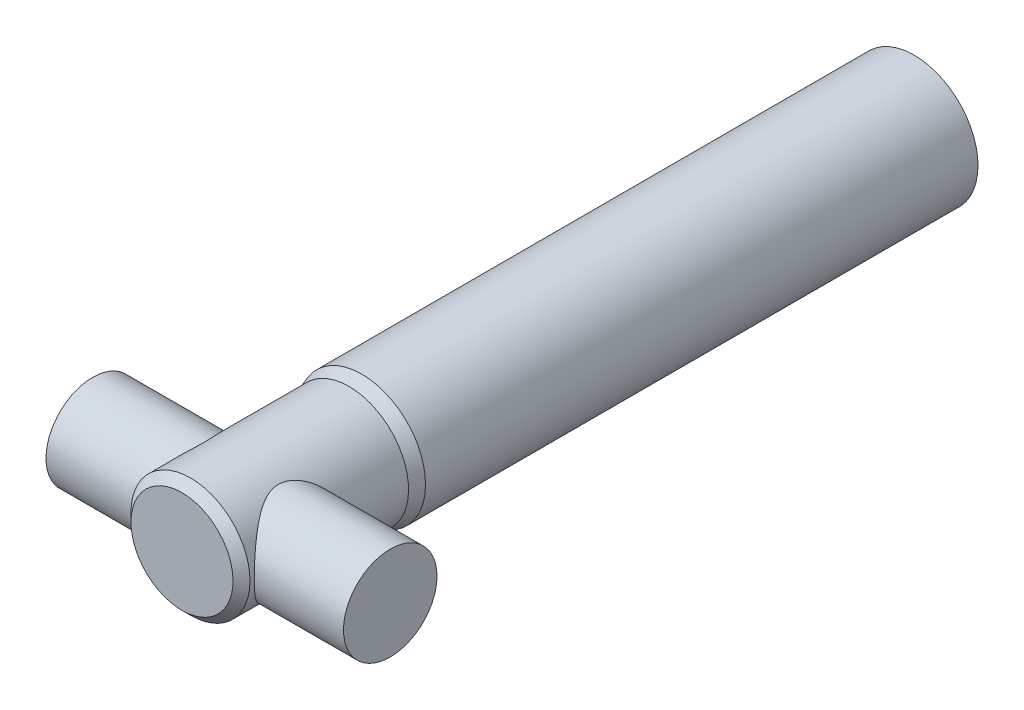
ISO-10303-21;
HEADER;
FILE_DESCRIPTION(('STEP AP214'),'2;1');
FILE_NAME('part.step','',(''),(''),'','','');
FILE_SCHEMA(('AUTOMOTIVE_DESIGN { 1 0 10303 214 1 1 1 1 }'));
ENDSEC;
DATA;
#1=APPLICATION_CONTEXT('core data for automotive mechanical design processes');
#2=APPLICATION_PROTOCOL_DEFINITION('international standard','automotive_design',2000,#1);
#3=PRODUCT_CONTEXT('',#1,'mechanical');
#4=PRODUCT('Part','Part','',(#3));
#5=PRODUCT_RELATED_PRODUCT_CATEGORY('part','',(#4));
#6=PRODUCT_DEFINITION_FORMATION('','',#4);
#7=PRODUCT_DEFINITION_CONTEXT('part definition',#1,'design');
#8=PRODUCT_DEFINITION('design','',#6,#7);
#9=PRODUCT_DEFINITION_SHAPE('','',#8);
#10=(LENGTH_UNIT() NAMED_UNIT(*) SI_UNIT(.MILLI.,.METRE.));
#11=(NAMED_UNIT(*) PLANE_ANGLE_UNIT() SI_UNIT($,.RADIAN.));
#12=(NAMED_UNIT(*) SI_UNIT($,.STERADIAN.) SOLID_ANGLE_UNIT());
#13=UNCERTAINTY_MEASURE_WITH_UNIT(LENGTH_MEASURE(1.E-05),#10,'distance_accuracy_value','');
#14=(GEOMETRIC_REPRESENTATION_CONTEXT(3) GLOBAL_UNCERTAINTY_ASSIGNED_CONTEXT((#13)) GLOBAL_UNIT_ASSIGNED_CONTEXT((#10,
#11,#12)) REPRESENTATION_CONTEXT('',''));
#15=CARTESIAN_POINT('',(0.,0.,0.));
#16=DIRECTION('',(0.,0.,1.));
#17=DIRECTION('',(1.,0.,0.));
#18=AXIS2_PLACEMENT_3D('',#15,#16,#17);
#19=CARTESIAN_POINT('',(0.,0.,130.));
#20=DIRECTION('',(0.,0.,-1.));
#21=DIRECTION('',(0.,1.,0.));
#22=AXIS2_PLACEMENT_3D('',#19,#20,#21);
#23=CYLINDRICAL_SURFACE('',#22,14.);
#24=CARTESIAN_POINT('',(0.,0.,170.3));
#25=DIRECTION('',(0.,0.,1.));
#26=DIRECTION('',(0.,-1.,0.));
#27=AXIS2_PLACEMENT_3D('',#24,#25,#26);
#28=CIRCLE('',#27,14.);
#29=CARTESIAN_POINT('',(0.,-14.,170.3));
#30=VERTEX_POINT('',#29);
#31=EDGE_CURVE('E58',#30,#30,#28,.F.);
#32=ORIENTED_EDGE('',*,*,#31,.T.);
#33=EDGE_LOOP('',(#32));
#34=FACE_BOUND('',#33,.T.);
#35=CARTESIAN_POINT('',(-14.,0.,169.3));
#36=CARTESIAN_POINT('',(-13.9999983020981,-0.265466786324723,169.299998254314));
#37=CARTESIAN_POINT('',(-13.9924325765758,-0.530963591409591,169.290373671565));
#38=CARTESIAN_POINT('',(-13.9623411819814,-1.05982996838332,169.25203676779));
#39=CARTESIAN_POINT('',(-13.9398080799739,-1.3231984175032,169.223314962902));
#40=CARTESIAN_POINT('',(-13.8802548331161,-1.84604435302479,169.147213291809));
#41=CARTESIAN_POINT('',(-13.8432086295765,-2.10551396389435,169.099799863289));
#42=CARTESIAN_POINT('',(-13.7554710989268,-2.61813687434712,168.987105980894));
#43=CARTESIAN_POINT('',(-13.7047811841976,-2.87129082475774,168.92182737639));
#44=CARTESIAN_POINT('',(-13.5911819530012,-3.36813213401964,168.774845434434));
#45=CARTESIAN_POINT('',(-13.5283514225214,-3.61186898304491,168.693247884536));
#46=CARTESIAN_POINT('',(-13.3914744973453,-4.09027178718101,168.51444552244));
#47=CARTESIAN_POINT('',(-13.317428053715,-4.32493770271056,168.417240642149));
#48=CARTESIAN_POINT('',(-13.1594291408938,-4.78418042798745,168.20834216801));
#49=CARTESIAN_POINT('',(-13.0754787805349,-5.00875937153341,168.096651658073));
#50=CARTESIAN_POINT('',(-12.8989847840232,-5.4472074677395,167.859813862915));
#51=CARTESIAN_POINT('',(-12.8064394219511,-5.66107445605585,167.734663874162));
#52=CARTESIAN_POINT('',(-12.5814694733874,-6.14824880000131,167.427309506395));
#53=CARTESIAN_POINT('',(-12.446164643204,-6.41711588357778,167.240150193891));
#54=CARTESIAN_POINT('',(-12.1657640325496,-6.93402514973809,166.845473419482));
#55=CARTESIAN_POINT('',(-12.0206652268966,-7.18206084429822,166.637949658302));
#56=CARTESIAN_POINT('',(-11.7235410038569,-7.65750353396232,166.203581359714));
#57=CARTESIAN_POINT('',(-11.5714983189204,-7.88485436702914,165.976687283778));
#58=CARTESIAN_POINT('',(-11.2642259522141,-8.31791382299805,165.505191057963));
#59=CARTESIAN_POINT('',(-11.1089966147273,-8.52362476929958,165.260590813903));
#60=CARTESIAN_POINT('',(-10.7967180361465,-8.91597608664955,164.750611365893));
#61=CARTESIAN_POINT('',(-10.6396750047223,-9.102297045149,164.484982491918));
#62=CARTESIAN_POINT('',(-10.3303157301918,-9.45193397170477,163.936206593476));
#63=CARTESIAN_POINT('',(-10.1780009229014,-9.61524300401537,163.653054324347));
#64=CARTESIAN_POINT('',(-9.8838097725818,-9.91738999970861,163.070000977611));
#65=CARTESIAN_POINT('',(-9.74190479027814,-10.0562966911596,162.770150177464));
#66=CARTESIAN_POINT('',(-9.47458547223412,-10.3085382479343,162.152920059512));
#67=CARTESIAN_POINT('',(-9.34915735162854,-10.4218945467957,161.835555713686));
#68=CARTESIAN_POINT('',(-9.16941263078586,-10.5796856375467,161.318327014121));
#69=CARTESIAN_POINT('',(-9.10710444778919,-10.6332626173461,161.123993392715));
#70=CARTESIAN_POINT('',(-8.9927048591134,-10.7301852097597,160.729871561394));
#71=CARTESIAN_POINT('',(-8.94060971889862,-10.7735345634262,160.530085375838));
#72=CARTESIAN_POINT('',(-8.84850683925216,-10.8493082663112,160.126103495336));
#73=CARTESIAN_POINT('',(-8.80847568073927,-10.8817537967564,159.921917179031));
#74=CARTESIAN_POINT('',(-8.74199011722624,-10.9352384406279,159.509840175406));
#75=CARTESIAN_POINT('',(-8.71553558935414,-10.9562776572845,159.30194952163));
#76=CARTESIAN_POINT('',(-8.67727733209552,-10.9866040786449,158.882330613135));
#77=CARTESIAN_POINT('',(-8.66558773795929,-10.9957997414291,158.670585145106));
#78=CARTESIAN_POINT('',(-8.65782499553423,-11.0019131246744,158.246635063247));
#79=CARTESIAN_POINT('',(-8.66175125829711,-10.9988313081775,158.034430467037));
#80=CARTESIAN_POINT('',(-8.68502871206392,-10.9804595050075,157.611224003095));
#81=CARTESIAN_POINT('',(-8.70439356112469,-10.965158708547,157.400223367014));
#82=CARTESIAN_POINT('',(-8.75761535337472,-10.9226973922513,156.981273687799));
#83=CARTESIAN_POINT('',(-8.79147434189971,-10.8955351985879,156.773325079636));
#84=CARTESIAN_POINT('',(-8.87942677304507,-10.8240260244805,156.324953998306));
#85=CARTESIAN_POINT('',(-8.93605750019766,-10.777473093471,156.085382583866));
#86=CARTESIAN_POINT('',(-9.06445775770566,-10.6697050529474,155.613745087713));
#87=CARTESIAN_POINT('',(-9.13623078566688,-10.6084865555013,155.381680754313));
#88=CARTESIAN_POINT('',(-9.29207211266342,-10.4722547095067,154.925279593194));
#89=CARTESIAN_POINT('',(-9.37616885264355,-10.3972093450419,154.700962164976));
#90=CARTESIAN_POINT('',(-9.55373083226909,-10.2342932159671,154.260903110036));
#91=CARTESIAN_POINT('',(-9.64719676514373,-10.146421502112,154.045162119539));
#92=CARTESIAN_POINT('',(-9.88442410250681,-9.91646434817246,153.527581084324));
#93=CARTESIAN_POINT('',(-10.0319732711895,-9.76771682640062,153.230422642264));
#94=CARTESIAN_POINT('',(-10.335333449104,-9.44615360861149,152.653832728578));
#95=CARTESIAN_POINT('',(-10.491147862878,-9.27332794612491,152.374408667672));
#96=CARTESIAN_POINT('',(-10.8061776836049,-8.90423857571701,151.833009865333));
#97=CARTESIAN_POINT('',(-10.9653965476636,-8.70795001376253,151.571054093613));
#98=CARTESIAN_POINT('',(-11.2828133220086,-8.29255461411112,151.065320216574));
#99=CARTESIAN_POINT('',(-11.4410113819469,-8.07345120572291,150.821539388799));
#100=CARTESIAN_POINT('',(-11.7557051229129,-7.60814225193955,150.348370930277));
#101=CARTESIAN_POINT('',(-11.9121066156436,-7.3614895623032,150.119359203392));
#102=CARTESIAN_POINT('',(-12.216221512472,-6.84498015214171,149.682539170338));
#103=CARTESIAN_POINT('',(-12.3639336869602,-6.57512016083225,149.474733862008));
#104=CARTESIAN_POINT('',(-12.6466079069709,-6.01347823961888,149.082894038075));
#105=CARTESIAN_POINT('',(-12.7815992921545,-5.72174968718987,148.898804444551));
#106=CARTESIAN_POINT('',(-13.0354912384641,-5.11696963977077,148.556426988802));
#107=CARTESIAN_POINT('',(-13.1543993873626,-4.80392830529129,148.398126952285));
#108=CARTESIAN_POINT('',(-13.3404746842738,-4.2532010059447,148.152455813518));
#109=CARTESIAN_POINT('',(-13.4125855517037,-4.02035981528025,148.057902475573));
#110=CARTESIAN_POINT('',(-13.5457290534993,-3.54596516246148,147.884151683903));
#111=CARTESIAN_POINT('',(-13.6067644246957,-3.30441387036591,147.804950436241));
#112=CARTESIAN_POINT('',(-13.7165895533296,-2.81394599397508,147.66294903859));
#113=CARTESIAN_POINT('',(-13.7653856829821,-2.56503331807762,147.600140353316));
#114=CARTESIAN_POINT('',(-13.8497815045618,-2.06125474078723,147.49178072745));
#115=CARTESIAN_POINT('',(-13.8853808128215,-1.80638866654178,147.446230288601));
#116=CARTESIAN_POINT('',(-13.9427314100867,-1.29138010586426,147.372956367761));
#117=CARTESIAN_POINT('',(-13.9644203287058,-1.03121917752045,147.345313171473));
#118=CARTESIAN_POINT('',(-13.9931977319387,-0.508778346888179,147.308652844574));
#119=CARTESIAN_POINT('',(-14.000286252122,-0.246498449763531,147.299635668586));
#120=CARTESIAN_POINT('',(-13.9996960166729,0.278009512880389,147.300386898407));
#121=CARTESIAN_POINT('',(-13.9920176485861,0.540237579579278,147.310154811217));
#122=CARTESIAN_POINT('',(-13.9620747335434,1.06248482048919,147.348302833958));
#123=CARTESIAN_POINT('',(-13.9398107111202,1.32250407379348,147.376682274579));
#124=CARTESIAN_POINT('',(-13.88319549443,1.82084291565739,147.449028360116));
#125=CARTESIAN_POINT('',(-13.8497632805995,2.05944104549108,147.491811434457));
#126=CARTESIAN_POINT('',(-13.7713100137218,2.53145321052372,147.592527062112));
#127=CARTESIAN_POINT('',(-13.726289591075,2.76486752697285,147.65045879134));
#128=CARTESIAN_POINT('',(-13.6254694876208,3.22523057781876,147.780726298518));
#129=CARTESIAN_POINT('',(-13.5696701882477,3.45217954068022,147.85306156677));
#130=CARTESIAN_POINT('',(-13.4482000967281,3.8986493431783,148.011333432764));
#131=CARTESIAN_POINT('',(-13.3825254946469,4.11816727567003,148.097275280663));
#132=CARTESIAN_POINT('',(-13.2369850347911,4.56526271474977,148.288908599948));
#133=CARTESIAN_POINT('',(-13.1564193030118,4.79218073826316,148.395605715582));
#134=CARTESIAN_POINT('',(-12.9863155719505,5.23565119477154,148.622704195371));
#135=CARTESIAN_POINT('',(-12.8967738887684,5.45219931743868,148.743111189096));
#136=CARTESIAN_POINT('',(-12.7100671048098,5.87430474763566,148.996604993562));
#137=CARTESIAN_POINT('',(-12.6129015536237,6.07986140459384,149.129692553557));
#138=CARTESIAN_POINT('',(-12.4122710766037,6.4796264365047,149.407659103169));
#139=CARTESIAN_POINT('',(-12.3088053052718,6.67383328141343,149.552539676307));
#140=CARTESIAN_POINT('',(-12.076293776484,7.0872969243098,149.882568981527));
#141=CARTESIAN_POINT('',(-11.9461859315793,7.30408219921029,150.070070007069));
#142=CARTESIAN_POINT('',(-11.6811800792678,7.7208163159309,150.459695874909));
#143=CARTESIAN_POINT('',(-11.5462827293612,7.92076745612231,150.661818713855));
#144=CARTESIAN_POINT('',(-11.2738248401161,8.30398803069368,151.080277343306));
#145=CARTESIAN_POINT('',(-11.1362607346037,8.48723294604124,151.296633246696));
#146=CARTESIAN_POINT('',(-10.8611961979661,8.83650477148732,151.742831679251));
#147=CARTESIAN_POINT('',(-10.7236957629572,9.00253292513358,151.972673232481));
#148=CARTESIAN_POINT('',(-10.4552847865941,9.31278348598826,152.439248811219));
#149=CARTESIAN_POINT('',(-10.3242967365558,9.4574762913146,152.675625139204));
#150=CARTESIAN_POINT('',(-10.0680637258111,9.72980164989494,153.161087016842));
#151=CARTESIAN_POINT('',(-9.94281964337171,9.85743159987109,153.410174497842));
#152=CARTESIAN_POINT('',(-9.70192746397449,10.0946086761143,153.920732288263));
#153=CARTESIAN_POINT('',(-9.58626396102627,10.2041851253826,154.182181612094));
#154=CARTESIAN_POINT('',(-9.36869929800787,10.4042929324955,154.717777335068));
#155=CARTESIAN_POINT('',(-9.26679138125834,10.4948336528769,154.991917411049));
#156=CARTESIAN_POINT('',(-9.1109587050962,10.6300277062168,155.464089432471));
#157=CARTESIAN_POINT('',(-9.05202806006739,10.6801537283675,155.658911793967));
#158=CARTESIAN_POINT('',(-8.94480238454955,10.7701165252613,156.053767256721));
#159=CARTESIAN_POINT('',(-8.89650390771088,10.8099566348432,156.253798645926));
#160=CARTESIAN_POINT('',(-8.81234133701151,10.8786763341108,156.657949719911));
#161=CARTESIAN_POINT('',(-8.77645455075857,10.9075759356661,156.862061214192));
#162=CARTESIAN_POINT('',(-8.71849444556228,10.9539601410702,157.27354426252));
#163=CARTESIAN_POINT('',(-8.69642086733625,10.971444959182,157.480915755299));
#164=CARTESIAN_POINT('',(-8.66702550020775,10.9946819266439,157.898727189171));
#165=CARTESIAN_POINT('',(-8.65980012037426,11.0003574011127,158.109178303414));
#166=CARTESIAN_POINT('',(-8.66075230715227,10.9996076823947,158.530017671241));
#167=CARTESIAN_POINT('',(-8.66892951823601,10.993182768513,158.740405926163));
#168=CARTESIAN_POINT('',(-8.70029347926512,10.9683766580998,159.159558538974));
#169=CARTESIAN_POINT('',(-8.72349608758353,10.9499828290228,159.368320945012));
#170=CARTESIAN_POINT('',(-8.78383014716833,10.9016424680038,159.782457737271));
#171=CARTESIAN_POINT('',(-8.82096365109482,10.8716942335492,159.987831619548));
#172=CARTESIAN_POINT('',(-8.9169985405825,10.7931354075333,160.438021001511));
#173=CARTESIAN_POINT('',(-8.97887307715571,10.7418872201405,160.681741123682));
#174=CARTESIAN_POINT('',(-9.11772937266534,10.6242771469901,161.161065402124));
#175=CARTESIAN_POINT('',(-9.19471518343286,10.5579112068964,161.396667361685));
#176=CARTESIAN_POINT('',(-9.36077761859899,10.4109630328551,161.859631420039));
#177=CARTESIAN_POINT('',(-9.44988217506742,10.3303478237317,162.086972898818));
#178=CARTESIAN_POINT('',(-9.63712943892932,10.1558911589253,162.532628858582));
#179=CARTESIAN_POINT('',(-9.73527268603141,10.0620489132658,162.750942799395));
#180=CARTESIAN_POINT('',(-9.98191224941213,9.81850355697994,163.271056992514));
#181=CARTESIAN_POINT('',(-10.1338355596977,9.6621888328227,163.568151270657));
#182=CARTESIAN_POINT('',(-10.4448846909376,9.32507724152265,164.144171936748));
#183=CARTESIAN_POINT('',(-10.6040133191854,9.14427077645119,164.423091138385));
#184=CARTESIAN_POINT('',(-10.9246235229077,8.7587400261217,164.96292482659));
#185=CARTESIAN_POINT('',(-11.0861071925577,8.55399315349223,165.223821934451));
#186=CARTESIAN_POINT('',(-11.4069965303405,8.12114657355916,165.726777881977));
#187=CARTESIAN_POINT('',(-11.5664025043524,7.89305034855054,165.968839521291));
#188=CARTESIAN_POINT('',(-11.8816080743876,7.41024398473724,166.436514182965));
#189=CARTESIAN_POINT('',(-12.0373212528652,7.15519442241601,166.661836068565));
#190=CARTESIAN_POINT('',(-12.3388844236082,6.62161931743809,167.090405859818));
#191=CARTESIAN_POINT('',(-12.4847328991417,6.34309017943759,167.293650373896));
#192=CARTESIAN_POINT('',(-12.7624347594877,5.76395428640985,167.67533095092));
#193=CARTESIAN_POINT('',(-12.894318389329,5.463397732547,167.853820898413));
#194=CARTESIAN_POINT('',(-13.1406169560295,4.84107419599956,168.18371645688));
#195=CARTESIAN_POINT('',(-13.2550415826491,4.5193191215366,168.335137099409));
#196=CARTESIAN_POINT('',(-13.4304272675694,3.95991068164669,168.565479253589));
#197=CARTESIAN_POINT('',(-13.4969488645249,3.72721800774293,168.652303214352));
#198=CARTESIAN_POINT('',(-13.6188110189529,3.25386829502407,168.810688758397));
#199=CARTESIAN_POINT('',(-13.6741544184181,3.01321329873839,168.882254221322));
#200=CARTESIAN_POINT('',(-13.7725240672289,2.52572525931351,169.009062316318));
#201=CARTESIAN_POINT('',(-13.815575859238,2.2789062042076,169.064338805607));
#202=CARTESIAN_POINT('',(-13.8886333871956,1.78025504698694,169.157946225526));
#203=CARTESIAN_POINT('',(-13.9186446251428,1.52842510603021,169.196284302831));
#204=CARTESIAN_POINT('',(-13.9611157369538,1.06402075391184,169.250478599471));
#205=CARTESIAN_POINT('',(-13.975675267127,0.851947333494551,169.269027228579));
#206=CARTESIAN_POINT('',(-13.9951192193843,0.426589251147054,169.293790081729));
#207=CARTESIAN_POINT('',(-14.0000013642754,0.213304315972458,169.300001402671));
#208=CARTESIAN_POINT('',(-14.,0.,169.3));
#209=B_SPLINE_CURVE_WITH_KNOTS('',3,(#35,#36,#37,#38,#39,#40,#41,#42,#43,#44,#45,#46,#47,#48,
#49,#50,#51,#52,#53,#54,#55,#56,#57,#58,#59,#60,#61,#62,#63,#64,#65,#66,#67,#68,#69,#70,#71,#72,
#73,#74,#75,#76,#77,#78,#79,#80,#81,#82,#83,#84,#85,#86,#87,#88,#89,#90,#91,#92,#93,#94,#95,#96,
#97,#98,#99,#100,#101,#102,#103,#104,#105,#106,#107,#108,#109,#110,#111,#112,#113,#114,#115,
#116,#117,#118,#119,#120,#121,#122,#123,#124,#125,#126,#127,#128,#129,#130,#131,#132,#133,#134,
#135,#136,#137,#138,#139,#140,#141,#142,#143,#144,#145,#146,#147,#148,#149,#150,#151,#152,#153,
#154,#155,#156,#157,#158,#159,#160,#161,#162,#163,#164,#165,#166,#167,#168,#169,#170,#171,#172,
#173,#174,#175,#176,#177,#178,#179,#180,#181,#182,#183,#184,#185,#186,#187,#188,#189,#190,#191,
#192,#193,#194,#195,#196,#197,#198,#199,#200,#201,#202,#203,#204,#205,#206,#207,#208),
.UNSPECIFIED.,.T.,.F.,(4,2,2,2,2,2,2,2,2,2,2,2,2,2,2,2,2,2,2,2,2,2,2,2,2,2,2,2,2,2,2,2,2,2,2,2,
2,2,2,2,2,2,2,2,2,2,2,2,2,2,2,2,2,2,2,2,2,2,2,2,2,2,2,2,2,2,2,2,2,2,2,2,2,2,2,2,2,2,2,2,2,2,2,2,
2,2,4),(0.,0.796173088899271,1.592741860504,2.39074749818668,3.18867055901866,3.98157962090334,
4.7744921422795,5.56723613321038,6.36013965671869,7.4219555710497,8.48410097539703,
9.54904916354969,10.613882894965,11.6941413376321,12.774724674662,13.8522140259226,
14.9287961081879,15.5613033580998,16.1935788901114,16.8246189980114,17.4556533947379,
18.0915365146554,18.7273956526213,19.3638179412454,20.0003300680121,20.7507930169512,
21.5014294998198,22.2538264270961,23.0062790655836,24.0955066319602,25.1851864004092,
26.2760308599142,27.366711590191,28.4787763276204,29.5909980545952,30.7005882887521,
31.8096531991728,32.5932537038495,33.3766603110225,34.1596581962888,34.942678843646,
35.7291862405157,36.5156917212876,37.3021765611064,38.0886331187224,38.8219175877846,
39.5551621744832,40.2883808184692,41.0218830706589,41.8112494429655,42.6009411229773,
43.3906794922703,44.1805240800878,45.123944086523,46.0672350778496,47.0118889314333,
47.9564745061147,48.8753587680842,49.7943830645146,50.7118996177263,51.6289638382211,
52.2573228884639,52.8854779592234,53.5124784214944,54.1394671142159,54.7705141321174,
55.4015465841587,56.0332461396318,56.6650388100133,57.4337185979515,58.2026047765436,
58.9732941543953,59.7440295806995,60.8479384027133,61.9522810875916,63.0576742387487,
64.1629027723915,65.2842389239412,66.4057470946938,67.5247743619672,68.6431782912984,
69.4137985995219,70.1842227346338,70.9530340336321,71.7215206442972,72.361100497038,
73.0008308319493),.UNSPECIFIED.);
#210=CARTESIAN_POINT('',(-14.,0.,169.3));
#211=VERTEX_POINT('',#210);
#212=EDGE_CURVE('E78',#211,#211,#209,.T.);
#213=ORIENTED_EDGE('',*,*,#212,.T.);
#214=EDGE_LOOP('',(#213));
#215=FACE_BOUND('',#214,.T.);
#216=CARTESIAN_POINT('',(0.,0.,133.));
#217=DIRECTION('',(0.,0.,-1.));
#218=DIRECTION('',(0.,1.,0.));
#219=AXIS2_PLACEMENT_3D('',#216,#217,#218);
#220=CIRCLE('',#219,14.);
#221=CARTESIAN_POINT('',(0.,14.,133.));
#222=VERTEX_POINT('',#221);
#223=EDGE_CURVE('E77',#222,#222,#220,.T.);
#224=ORIENTED_EDGE('',*,*,#223,.F.);
#225=EDGE_LOOP('',(#224));
#226=FACE_BOUND('',#225,.T.);
#227=CARTESIAN_POINT('',(14.,0.,169.3));
#228=CARTESIAN_POINT('',(13.9999983020981,0.265466786324724,169.299998254314));
#229=CARTESIAN_POINT('',(13.9924325765758,0.530963591409594,169.290373671565));
#230=CARTESIAN_POINT('',(13.9623411819814,1.05982996838333,169.25203676779));
#231=CARTESIAN_POINT('',(13.9398080799739,1.3231984175032,169.223314962902));
#232=CARTESIAN_POINT('',(13.8802548331161,1.8460443530248,169.147213291809));
#233=CARTESIAN_POINT('',(13.8432086295765,2.10551396389437,169.099799863289));
#234=CARTESIAN_POINT('',(13.7554710989268,2.61813687434713,168.987105980894));
#235=CARTESIAN_POINT('',(13.7047811841976,2.87129082475773,168.92182737639));
#236=CARTESIAN_POINT('',(13.5911819530012,3.36813213401965,168.774845434434));
#237=CARTESIAN_POINT('',(13.5283514225214,3.61186898304498,168.693247884536));
#238=CARTESIAN_POINT('',(13.3914744973452,4.09027178718112,168.51444552244));
#239=CARTESIAN_POINT('',(13.3174280537149,4.32493770271066,168.417240642149));
#240=CARTESIAN_POINT('',(13.1594291408938,4.78418042798757,168.20834216801));
#241=CARTESIAN_POINT('',(13.0754787805348,5.00875937153356,168.096651658073));
#242=CARTESIAN_POINT('',(12.8989847840232,5.4472074677396,167.859813862915));
#243=CARTESIAN_POINT('',(12.8064394219511,5.66107445605585,167.734663874162));
#244=CARTESIAN_POINT('',(12.5814694733874,6.14824880000132,167.427309506395));
#245=CARTESIAN_POINT('',(12.4461646432039,6.41711588357795,167.240150193891));
#246=CARTESIAN_POINT('',(12.1657640325494,6.9340251497384,166.845473419483));
#247=CARTESIAN_POINT('',(12.0206652268965,7.1820608442985,166.637949658303));
#248=CARTESIAN_POINT('',(11.7235410038567,7.65750353396263,166.203581359714));
#249=CARTESIAN_POINT('',(11.5714983189201,7.8848543670295,165.976687283778));
#250=CARTESIAN_POINT('',(11.2642259522139,8.31791382299835,165.505191057963));
#251=CARTESIAN_POINT('',(11.1089966147273,8.52362476929978,165.260590813903));
#252=CARTESIAN_POINT('',(10.7967180361465,8.9159760866498,164.750611365893));
#253=CARTESIAN_POINT('',(10.639675004722,9.1022970451494,164.484982491918));
#254=CARTESIAN_POINT('',(10.3303157301913,9.45193397170526,163.936206593477));
#255=CARTESIAN_POINT('',(10.178000922901,9.61524300401581,163.653054324347));
#256=CARTESIAN_POINT('',(9.88380977258129,9.91738999970911,163.070000977612));
#257=CARTESIAN_POINT('',(9.74190479027744,10.0562966911602,162.770150177465));
#258=CARTESIAN_POINT('',(9.4745854722338,10.3085382479346,162.152920059512));
#259=CARTESIAN_POINT('',(9.34915735162879,10.4218945467956,161.835555713686));
#260=CARTESIAN_POINT('',(9.16941263078571,10.5796856375469,161.318327014121));
#261=CARTESIAN_POINT('',(9.10710444778862,10.6332626173466,161.123993392716));
#262=CARTESIAN_POINT('',(8.99270485911255,10.7301852097604,160.729871561394));
#263=CARTESIAN_POINT('',(8.9406097188979,10.7735345634268,160.530085375838));
#264=CARTESIAN_POINT('',(8.84850683925138,10.8493082663119,160.126103495337));
#265=CARTESIAN_POINT('',(8.80847568073829,10.8817537967571,159.921917179031));
#266=CARTESIAN_POINT('',(8.74199011722564,10.9352384406284,159.509840175407));
#267=CARTESIAN_POINT('',(8.71553558935415,10.9562776572845,159.30194952163));
#268=CARTESIAN_POINT('',(8.67727733209551,10.9866040786449,158.882330613135));
#269=CARTESIAN_POINT('',(8.66558773795864,10.9957997414296,158.670585145105));
#270=CARTESIAN_POINT('',(8.65782499553317,11.0019131246752,158.246635063247));
#271=CARTESIAN_POINT('',(8.66175125829625,10.9988313081782,158.034430467037));
#272=CARTESIAN_POINT('',(8.68502871206308,10.9804595050082,157.611224003095));
#273=CARTESIAN_POINT('',(8.70439356112367,10.9651587085478,157.400223367014));
#274=CARTESIAN_POINT('',(8.75761535337408,10.9226973922518,156.981273687799));
#275=CARTESIAN_POINT('',(8.79147434189963,10.8955351985879,156.773325079636));
#276=CARTESIAN_POINT('',(8.87942677304516,10.8240260244805,156.324953998305));
#277=CARTESIAN_POINT('',(8.93605750019716,10.7774730934714,156.085382583865));
#278=CARTESIAN_POINT('',(9.06445775770478,10.6697050529481,155.613745087713));
#279=CARTESIAN_POINT('',(9.1362307856662,10.6084865555019,155.381680754312));
#280=CARTESIAN_POINT('',(9.29207211266282,10.4722547095072,154.925279593194));
#281=CARTESIAN_POINT('',(9.37616885264284,10.3972093450426,154.700962164975));
#282=CARTESIAN_POINT('',(9.55373083226862,10.2342932159675,154.260903110035));
#283=CARTESIAN_POINT('',(9.64719676514363,10.1464215021121,154.045162119539));
#284=CARTESIAN_POINT('',(9.88442410250695,9.91646434817234,153.527581084324));
#285=CARTESIAN_POINT('',(10.0319732711892,9.76771682640089,153.230422642264));
#286=CARTESIAN_POINT('',(10.3353334491035,9.44615360861203,152.653832728578));
#287=CARTESIAN_POINT('',(10.4911478628776,9.27332794612532,152.374408667672));
#288=CARTESIAN_POINT('',(10.8061776836046,8.90423857571737,151.833009865333));
#289=CARTESIAN_POINT('',(10.9653965476633,8.70795001376296,151.571054093612));
#290=CARTESIAN_POINT('',(11.2828133220083,8.29255461411143,151.065320216574));
#291=CARTESIAN_POINT('',(11.4410113819469,8.07345120572304,150.821539388799));
#292=CARTESIAN_POINT('',(11.7557051229128,7.60814225193964,150.348370930277));
#293=CARTESIAN_POINT('',(11.9121066156435,7.36148956230344,150.119359203392));
#294=CARTESIAN_POINT('',(12.2162215124718,6.84498015214207,149.682539170338));
#295=CARTESIAN_POINT('',(12.3639336869601,6.57512016083257,149.474733862007));
#296=CARTESIAN_POINT('',(12.6466079069707,6.01347823961919,149.082894038075));
#297=CARTESIAN_POINT('',(12.7815992921543,5.7217496871902,148.89880444455));
#298=CARTESIAN_POINT('',(13.035491238464,5.11696963977111,148.556426988802));
#299=CARTESIAN_POINT('',(13.1543993873626,4.80392830529161,148.398126952285));
#300=CARTESIAN_POINT('',(13.3404746842738,4.253201005945,148.152455813518));
#301=CARTESIAN_POINT('',(13.4125855517036,4.02035981528055,148.057902475573));
#302=CARTESIAN_POINT('',(13.5457290534992,3.54596516246172,147.884151683903));
#303=CARTESIAN_POINT('',(13.6067644246957,3.30441387036611,147.804950436241));
#304=CARTESIAN_POINT('',(13.7165895533295,2.8139459939752,147.66294903859));
#305=CARTESIAN_POINT('',(13.7653856829821,2.5650333180777,147.600140353316));
#306=CARTESIAN_POINT('',(13.8497815045618,2.06125474078722,147.49178072745));
#307=CARTESIAN_POINT('',(13.8853808128215,1.80638866654172,147.446230288601));
#308=CARTESIAN_POINT('',(13.9427314100867,1.29138010586415,147.372956367761));
#309=CARTESIAN_POINT('',(13.9644203287058,1.03121917752035,147.345313171473));
#310=CARTESIAN_POINT('',(13.9931977319387,0.508778346888089,147.308652844574));
#311=CARTESIAN_POINT('',(14.000286252122,0.246498449763439,147.299635668586));
#312=CARTESIAN_POINT('',(13.9996960166729,-0.27800951288046,147.300386898407));
#313=CARTESIAN_POINT('',(13.9920176485861,-0.540237579579328,147.310154811217));
#314=CARTESIAN_POINT('',(13.9620747335434,-1.06248482048922,147.348302833959));
#315=CARTESIAN_POINT('',(13.9398107111202,-1.3225040737935,147.376682274579));
#316=CARTESIAN_POINT('',(13.88319549443,-1.82084291565734,147.449028360116));
#317=CARTESIAN_POINT('',(13.8497632805996,-2.05944104549096,147.491811434457));
#318=CARTESIAN_POINT('',(13.7713100137219,-2.53145321052349,147.592527062112));
#319=CARTESIAN_POINT('',(13.726289591075,-2.76486752697258,147.65045879134));
#320=CARTESIAN_POINT('',(13.6254694876209,-3.22523057781842,147.780726298518));
#321=CARTESIAN_POINT('',(13.5696701882478,-3.45217954067985,147.85306156677));
#322=CARTESIAN_POINT('',(13.4482000967282,-3.89864934317785,148.011333432764));
#323=CARTESIAN_POINT('',(13.3825254946469,-4.11816727566951,148.097275280663));
#324=CARTESIAN_POINT('',(13.2369850347911,-4.56526271474927,148.288908599948));
#325=CARTESIAN_POINT('',(13.1564193030119,-4.79218073826275,148.395605715582));
#326=CARTESIAN_POINT('',(12.9863155719506,-5.23565119477128,148.622704195371));
#327=CARTESIAN_POINT('',(12.8967738887685,-5.45219931743847,148.743111189096));
#328=CARTESIAN_POINT('',(12.7100671048099,-5.87430474763547,148.996604993563));
#329=CARTESIAN_POINT('',(12.6129015536238,-6.07986140459362,149.129692553558));
#330=CARTESIAN_POINT('',(12.4122710766037,-6.47962643650471,149.407659103169));
#331=CARTESIAN_POINT('',(12.3088053052718,-6.67383328141373,149.552539676307));
#332=CARTESIAN_POINT('',(12.076293776484,-7.08729692431011,149.882568981527));
#333=CARTESIAN_POINT('',(11.9461859315794,-7.30408219921025,150.07007000707));
#334=CARTESIAN_POINT('',(11.681180079268,-7.72081631593058,150.459695874909));
#335=CARTESIAN_POINT('',(11.5462827293613,-7.92076745612207,150.661818713855));
#336=CARTESIAN_POINT('',(11.2738248401164,-8.30398803069341,151.080277343306));
#337=CARTESIAN_POINT('',(11.136260734604,-8.48723294604086,151.296633246697));
#338=CARTESIAN_POINT('',(10.8611961979662,-8.8365047714871,151.742831679252));
#339=CARTESIAN_POINT('',(10.7236957629571,-9.00253292513362,151.972673232481));
#340=CARTESIAN_POINT('',(10.4552847865941,-9.31278348598824,152.439248811219));
#341=CARTESIAN_POINT('',(10.3242967365561,-9.45747629131426,152.675625139204));
#342=CARTESIAN_POINT('',(10.0680637258116,-9.72980164989445,153.161087016842));
#343=CARTESIAN_POINT('',(9.94281964337209,-9.85743159987076,153.410174497843));
#344=CARTESIAN_POINT('',(9.70192746397495,-10.0946086761138,153.920732288264));
#345=CARTESIAN_POINT('',(9.58626396102689,-10.2041851253818,154.182181612095));
#346=CARTESIAN_POINT('',(9.36869929800818,-10.4042929324954,154.717777335069));
#347=CARTESIAN_POINT('',(9.26679138125816,-10.4948336528778,154.991917411049));
#348=CARTESIAN_POINT('',(9.11095870509633,-10.6300277062173,155.464089432471));
#349=CARTESIAN_POINT('',(9.05202806006794,-10.6801537283672,155.658911793967));
#350=CARTESIAN_POINT('',(8.94480238455039,-10.7701165252604,156.053767256722));
#351=CARTESIAN_POINT('',(8.89650390771159,-10.8099566348426,156.253798645927));
#352=CARTESIAN_POINT('',(8.8123413370123,-10.8786763341101,156.657949719912));
#353=CARTESIAN_POINT('',(8.77645455075956,-10.9075759356652,156.862061214193));
#354=CARTESIAN_POINT('',(8.71849444556287,-10.9539601410698,157.27354426252));
#355=CARTESIAN_POINT('',(8.69642086733624,-10.9714449591823,157.480915755299));
#356=CARTESIAN_POINT('',(8.66702550020776,-10.9946819266443,157.898727189171));
#357=CARTESIAN_POINT('',(8.6598001203749,-11.0003574011123,158.109178303414));
#358=CARTESIAN_POINT('',(8.66075230715334,-10.9996076823937,158.530017671241));
#359=CARTESIAN_POINT('',(8.66892951823687,-10.9931827685123,158.740405926163));
#360=CARTESIAN_POINT('',(8.70029347926596,-10.9683766580992,159.159558538974));
#361=CARTESIAN_POINT('',(8.72349608758454,-10.949982829022,159.368320945012));
#362=CARTESIAN_POINT('',(8.783830147169,-10.9016424680033,159.782457737271));
#363=CARTESIAN_POINT('',(8.82096365109496,-10.8716942335492,159.987831619548));
#364=CARTESIAN_POINT('',(8.91699854058246,-10.7931354075333,160.438021001511));
#365=CARTESIAN_POINT('',(8.97887307715623,-10.7418872201401,160.681741123682));
#366=CARTESIAN_POINT('',(9.11772937266623,-10.6242771469893,161.161065402123));
#367=CARTESIAN_POINT('',(9.19471518343355,-10.5579112068958,161.396667361685));
#368=CARTESIAN_POINT('',(9.36077761859959,-10.4109630328546,161.859631420039));
#369=CARTESIAN_POINT('',(9.44988217506812,-10.3303478237311,162.086972898818));
#370=CARTESIAN_POINT('',(9.6371294389298,-10.1558911589248,162.532628858582));
#371=CARTESIAN_POINT('',(9.73527268603156,-10.0620489132657,162.750942799396));
#372=CARTESIAN_POINT('',(9.98191224941205,-9.81850355698006,163.271056992514));
#373=CARTESIAN_POINT('',(10.133835559698,-9.66218883282242,163.568151270656));
#374=CARTESIAN_POINT('',(10.4448846909381,-9.3250772415221,164.144171936747));
#375=CARTESIAN_POINT('',(10.6040133191858,-9.14427077645074,164.423091138385));
#376=CARTESIAN_POINT('',(10.924623522908,-8.75874002612131,164.962924826589));
#377=CARTESIAN_POINT('',(11.0861071925581,-8.55399315349176,165.223821934451));
#378=CARTESIAN_POINT('',(11.4069965303408,-8.12114657355873,165.726777881977));
#379=CARTESIAN_POINT('',(11.5664025043525,-7.8930503485502,165.968839521291));
#380=CARTESIAN_POINT('',(11.8816080743877,-7.41024398473693,166.436514182965));
#381=CARTESIAN_POINT('',(12.0373212528653,-7.15519442241563,166.661836068565));
#382=CARTESIAN_POINT('',(12.3388844236085,-6.62161931743769,167.090405859817));
#383=CARTESIAN_POINT('',(12.4847328991419,-6.34309017943722,167.293650373896));
#384=CARTESIAN_POINT('',(12.7624347594878,-5.76395428640949,167.67533095092));
#385=CARTESIAN_POINT('',(12.8943183893292,-5.46339773254663,167.853820898413));
#386=CARTESIAN_POINT('',(13.1406169560296,-4.8410741959993,168.18371645688));
#387=CARTESIAN_POINT('',(13.2550415826492,-4.51931912153647,168.335137099409));
#388=CARTESIAN_POINT('',(13.4304272675695,-3.95991068164659,168.565479253589));
#389=CARTESIAN_POINT('',(13.4969488645249,-3.72721800774279,168.652303214352));
#390=CARTESIAN_POINT('',(13.6188110189529,-3.25386829502393,168.810688758397));
#391=CARTESIAN_POINT('',(13.6741544184181,-3.01321329873828,168.882254221322));
#392=CARTESIAN_POINT('',(13.7725240672289,-2.52572525931344,169.009062316317));
#393=CARTESIAN_POINT('',(13.815575859238,-2.27890620420754,169.064338805607));
#394=CARTESIAN_POINT('',(13.8886333871956,-1.78025504698691,169.157946225526));
#395=CARTESIAN_POINT('',(13.9186446251428,-1.52842510603019,169.196284302831));
#396=CARTESIAN_POINT('',(13.9611157369538,-1.06402075391184,169.250478599471));
#397=CARTESIAN_POINT('',(13.975675267127,-0.851947333494541,169.269027228579));
#398=CARTESIAN_POINT('',(13.9951192193843,-0.426589251147044,169.293790081729));
#399=CARTESIAN_POINT('',(14.0000013642754,-0.213304315972453,169.300001402671));
#400=CARTESIAN_POINT('',(14.,0.,169.3));
#401=B_SPLINE_CURVE_WITH_KNOTS('',3,(#227,#228,#229,#230,#231,#232,#233,#234,#235,#236,#237,
#238,#239,#240,#241,#242,#243,#244,#245,#246,#247,#248,#249,#250,#251,#252,#253,#254,#255,#256,
#257,#258,#259,#260,#261,#262,#263,#264,#265,#266,#267,#268,#269,#270,#271,#272,#273,#274,#275,
#276,#277,#278,#279,#280,#281,#282,#283,#284,#285,#286,#287,#288,#289,#290,#291,#292,#293,#294,
#295,#296,#297,#298,#299,#300,#301,#302,#303,#304,#305,#306,#307,#308,#309,#310,#311,#312,#313,
#314,#315,#316,#317,#318,#319,#320,#321,#322,#323,#324,#325,#326,#327,#328,#329,#330,#331,#332,
#333,#334,#335,#336,#337,#338,#339,#340,#341,#342,#343,#344,#345,#346,#347,#348,#349,#350,#351,
#352,#353,#354,#355,#356,#357,#358,#359,#360,#361,#362,#363,#364,#365,#366,#367,#368,#369,#370,
#371,#372,#373,#374,#375,#376,#377,#378,#379,#380,#381,#382,#383,#384,#385,#386,#387,#388,#389,
#390,#391,#392,#393,#394,#395,#396,#397,#398,#399,#400),.UNSPECIFIED.,.T.,.F.,(4,2,2,2,2,2,2,2,
2,2,2,2,2,2,2,2,2,2,2,2,2,2,2,2,2,2,2,2,2,2,2,2,2,2,2,2,2,2,2,2,2,2,2,2,2,2,2,2,2,2,2,2,2,2,2,2,
2,2,2,2,2,2,2,2,2,2,2,2,2,2,2,2,2,2,2,2,2,2,2,2,2,2,2,2,2,2,4),(0.,0.796173088899275,
1.59274186050401,2.39074749818667,3.18867055901868,3.98157962090339,4.77449214227955,
5.56723613321041,6.36013965671876,7.42195557104984,8.48410097539722,9.54904916354989,
10.6138828949653,11.6941413376325,12.7747246746623,13.8522140259228,14.9287961081883,
15.5613033581003,16.1935788901119,16.8246189980119,17.4556533947385,18.0915365146562,
18.7273956526221,19.3638179412462,20.000330068013,20.7507930169523,21.5014294998208,
22.2538264270971,23.0062790655847,24.0955066319614,25.1851864004104,26.2760308599154,
27.3667115901922,28.4787763276217,29.5909980545964,30.7005882887532,31.8096531991739,
32.5932537038507,33.3766603110238,34.1596581962902,34.9426788436475,35.7291862405172,
36.5156917212891,37.3021765611078,38.0886331187239,38.8219175877859,39.5551621744844,
40.2883808184702,41.0218830706598,41.8112494429666,42.6009411229786,43.3906794922718,
44.1805240800894,45.1239440865244,46.0672350778509,47.0118889314346,47.9564745061159,
48.8753587680854,49.7943830645159,50.7118996177277,51.6289638382224,52.257322888465,
52.8854779592245,53.5124784214956,54.1394671142168,54.7705141321181,55.4015465841594,
56.0332461396326,56.665038810014,57.433718597952,58.2026047765441,58.9732941543959,
59.7440295806999,60.8479384027136,61.952281087592,63.0576742387491,64.162902772392,
65.2842389239416,66.4057470946942,67.5247743619675,68.6431782912987,69.4137985995221,
70.1842227346339,70.9530340336322,71.7215206442973,72.3611004970381,73.0008308319494),.UNSPECIFIED.);
#402=CARTESIAN_POINT('',(14.,0.,169.3));
#403=VERTEX_POINT('',#402);
#404=EDGE_CURVE('E69',#403,#403,#401,.T.);
#405=ORIENTED_EDGE('',*,*,#404,.T.);
#406=EDGE_LOOP('',(#405));
#407=FACE_BOUND('',#406,.T.);
#408=ADVANCED_FACE('F51',(#34,#215,#226,#407),#23,.T.);
#409=CARTESIAN_POINT('',(0.,0.,130.));
#410=DIRECTION('',(0.,0.,-1.));
#411=DIRECTION('',(-1.,0.,0.));
#412=AXIS2_PLACEMENT_3D('',#409,#410,#411);
#413=CYLINDRICAL_SURFACE('',#412,15.);
#414=CARTESIAN_POINT('',(0.,0.,130.));
#415=DIRECTION('',(0.,0.,1.));
#416=DIRECTION('',(1.,0.,0.));
#417=AXIS2_PLACEMENT_3D('',#414,#415,#416);
#418=CIRCLE('',#417,15.);
#419=CARTESIAN_POINT('',(15.,0.,130.));
#420=VERTEX_POINT('',#419);
#421=EDGE_CURVE('E62',#420,#420,#418,.T.);
#422=ORIENTED_EDGE('',*,*,#421,.F.);
#423=EDGE_LOOP('',(#422));
#424=FACE_BOUND('',#423,.T.);
#425=CARTESIAN_POINT('',(0.,0.,0.));
#426=DIRECTION('',(0.,0.,1.));
#427=DIRECTION('',(1.,0.,0.));
#428=AXIS2_PLACEMENT_3D('',#425,#426,#427);
#429=CIRCLE('',#428,15.);
#430=CARTESIAN_POINT('',(15.,0.,0.));
#431=VERTEX_POINT('',#430);
#432=EDGE_CURVE('E66',#431,#431,#429,.T.);
#433=ORIENTED_EDGE('',*,*,#432,.T.);
#434=EDGE_LOOP('',(#433));
#435=FACE_BOUND('',#434,.T.);
#436=ADVANCED_FACE('F108',(#424,#435),#413,.T.);
#437=CARTESIAN_POINT('',(0.,0.,0.));
#438=DIRECTION('',(0.,0.,1.));
#439=DIRECTION('',(1.,0.,0.));
#440=AXIS2_PLACEMENT_3D('',#437,#438,#439);
#441=PLANE('',#440);
#442=ORIENTED_EDGE('',*,*,#432,.F.);
#443=EDGE_LOOP('',(#442));
#444=FACE_BOUND('',#443,.T.);
#445=ADVANCED_FACE('F104',(#444),#441,.F.);
#446=CARTESIAN_POINT('',(0.,0.,172.3));
#447=DIRECTION('',(0.,0.,1.));
#448=DIRECTION('',(0.,-1.,0.));
#449=AXIS2_PLACEMENT_3D('',#446,#447,#448);
#450=PLANE('',#449);
#451=CARTESIAN_POINT('',(0.,0.,172.3));
#452=DIRECTION('',(0.,0.,1.));
#453=DIRECTION('',(0.,-1.,0.));
#454=AXIS2_PLACEMENT_3D('',#451,#452,#453);
#455=CIRCLE('',#454,12.);
#456=CARTESIAN_POINT('',(0.,-12.0000000000001,172.3));
#457=VERTEX_POINT('',#456);
#458=EDGE_CURVE('E12',#457,#457,#455,.T.);
#459=ORIENTED_EDGE('',*,*,#458,.T.);
#460=EDGE_LOOP('',(#459));
#461=FACE_BOUND('',#460,.T.);
#462=ADVANCED_FACE('F97',(#461),#450,.T.);
#463=CARTESIAN_POINT('',(0.,0.,130.));
#464=DIRECTION('',(0.,0.,-1.));
#465=DIRECTION('',(0.,1.,0.));
#466=AXIS2_PLACEMENT_3D('',#463,#464,#465);
#467=CONICAL_SURFACE('',#466,15.,0.321750554396643);
#468=ORIENTED_EDGE('',*,*,#223,.T.);
#469=EDGE_LOOP('',(#468));
#470=FACE_BOUND('',#469,.T.);
#471=ORIENTED_EDGE('',*,*,#421,.T.);
#472=EDGE_LOOP('',(#471));
#473=FACE_BOUND('',#472,.T.);
#474=ADVANCED_FACE('F94',(#470,#473),#467,.T.);
#475=CARTESIAN_POINT('',(-35.,3.33066907387547E-13,158.3));
#476=DIRECTION('',(1.,0.,0.));
#477=DIRECTION('',(0.,0.,-1.));
#478=AXIS2_PLACEMENT_3D('',#475,#476,#477);
#479=PLANE('',#478);
#480=CARTESIAN_POINT('',(-35.,3.33066907387547E-13,158.3));
#481=DIRECTION('',(1.,0.,0.));
#482=DIRECTION('',(0.,0.,-1.));
#483=AXIS2_PLACEMENT_3D('',#480,#481,#482);
#484=CIRCLE('',#483,11.);
#485=CARTESIAN_POINT('',(-35.,3.32990579554604E-13,147.3));
#486=VERTEX_POINT('',#485);
#487=EDGE_CURVE('E128',#486,#486,#484,.T.);
#488=ORIENTED_EDGE('',*,*,#487,.F.);
#489=EDGE_LOOP('',(#488));
#490=FACE_BOUND('',#489,.T.);
#491=ADVANCED_FACE('F91',(#490),#479,.F.);
#492=CARTESIAN_POINT('',(35.,3.33066907387547E-13,158.3));
#493=DIRECTION('',(-1.,0.,0.));
#494=DIRECTION('',(0.,0.,1.));
#495=AXIS2_PLACEMENT_3D('',#492,#493,#494);
#496=CYLINDRICAL_SURFACE('',#495,11.);
#497=ORIENTED_EDGE('',*,*,#212,.F.);
#498=EDGE_LOOP('',(#497));
#499=FACE_BOUND('',#498,.T.);
#500=ORIENTED_EDGE('',*,*,#487,.T.);
#501=EDGE_LOOP('',(#500));
#502=FACE_BOUND('',#501,.T.);
#503=ADVANCED_FACE('F86',(#499,#502),#496,.T.);
#504=ORIENTED_EDGE('',*,*,#404,.F.);
#505=EDGE_LOOP('',(#504));
#506=FACE_BOUND('',#505,.T.);
#507=CARTESIAN_POINT('',(35.,3.33066907387547E-13,158.3));
#508=DIRECTION('',(1.,0.,0.));
#509=DIRECTION('',(0.,0.,-1.));
#510=AXIS2_PLACEMENT_3D('',#507,#508,#509);
#511=CIRCLE('',#510,11.);
#512=CARTESIAN_POINT('',(35.,3.32990579554604E-13,147.3));
#513=VERTEX_POINT('',#512);
#514=EDGE_CURVE('E126',#513,#513,#511,.T.);
#515=ORIENTED_EDGE('',*,*,#514,.F.);
#516=EDGE_LOOP('',(#515));
#517=FACE_BOUND('',#516,.T.);
#518=ADVANCED_FACE('F90',(#506,#517),#496,.T.);
#519=CARTESIAN_POINT('',(35.,3.33066907387547E-13,158.3));
#520=DIRECTION('',(1.,0.,0.));
#521=DIRECTION('',(0.,0.,-1.));
#522=AXIS2_PLACEMENT_3D('',#519,#520,#521);
#523=PLANE('',#522);
#524=ORIENTED_EDGE('',*,*,#514,.T.);
#525=EDGE_LOOP('',(#524));
#526=FACE_BOUND('',#525,.T.);
#527=ADVANCED_FACE('F123',(#526),#523,.T.);
#528=CARTESIAN_POINT('',(0.,0.,170.3));
#529=DIRECTION('',(0.,0.,-1.));
#530=DIRECTION('',(0.,1.,0.));
#531=AXIS2_PLACEMENT_3D('',#528,#529,#530);
#532=CONICAL_SURFACE('',#531,14.,0.785398163397445);
#533=ORIENTED_EDGE('',*,*,#458,.F.);
#534=EDGE_LOOP('',(#533));
#535=FACE_BOUND('',#534,.T.);
#536=ORIENTED_EDGE('',*,*,#31,.F.);
#537=EDGE_LOOP('',(#536));
#538=FACE_BOUND('',#537,.T.);
#539=ADVANCED_FACE('F53',(#535,#538),#532,.T.);
#540=CLOSED_SHELL('',(#408,#436,#445,#462,#474,#491,#503,#518,#527,#539));
#541=MANIFOLD_SOLID_BREP('B2',#540);
#542=ADVANCED_BREP_SHAPE_REPRESENTATION('',(#18,#541),#14);
#543=SHAPE_DEFINITION_REPRESENTATION(#9,#542);
ENDSEC;
END-ISO-10303-21;
